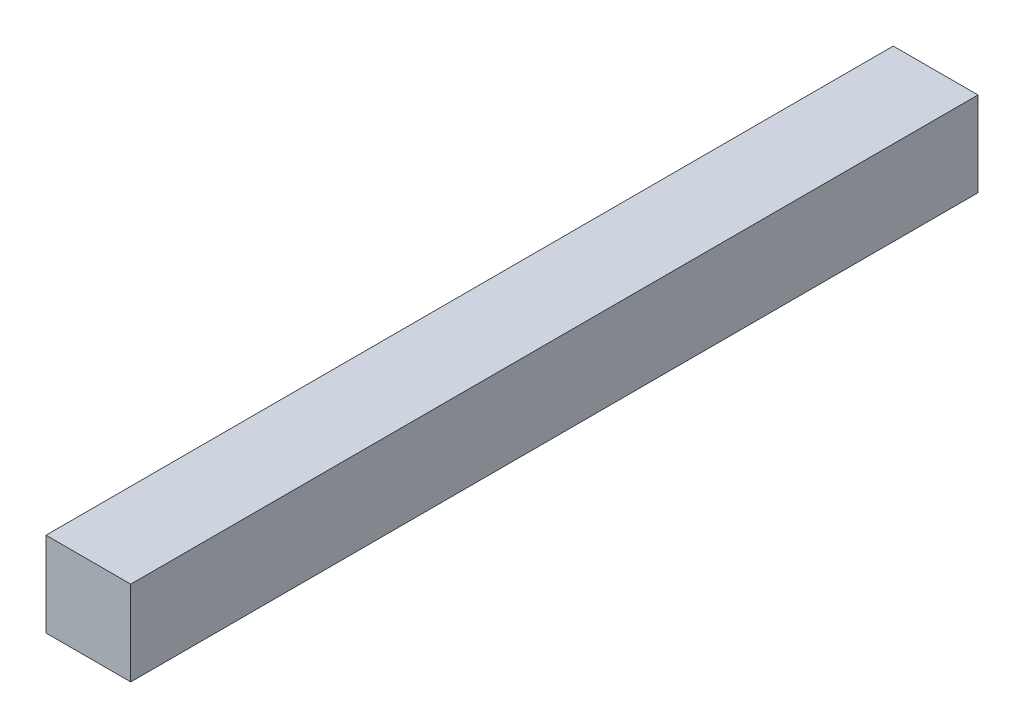
ISO-10303-21;
HEADER;
FILE_DESCRIPTION(('STEP AP214'),'2;1');
FILE_NAME('part.step','',(''),(''),'','','');
FILE_SCHEMA(('AUTOMOTIVE_DESIGN { 1 0 10303 214 1 1 1 1 }'));
ENDSEC;
DATA;
#1=APPLICATION_CONTEXT('core data for automotive mechanical design processes');
#2=APPLICATION_PROTOCOL_DEFINITION('international standard','automotive_design',2000,#1);
#3=PRODUCT_CONTEXT('',#1,'mechanical');
#4=PRODUCT('Part','Part','',(#3));
#5=PRODUCT_RELATED_PRODUCT_CATEGORY('part','',(#4));
#6=PRODUCT_DEFINITION_FORMATION('','',#4);
#7=PRODUCT_DEFINITION_CONTEXT('part definition',#1,'design');
#8=PRODUCT_DEFINITION('design','',#6,#7);
#9=PRODUCT_DEFINITION_SHAPE('','',#8);
#10=(LENGTH_UNIT() NAMED_UNIT(*) SI_UNIT(.MILLI.,.METRE.));
#11=(NAMED_UNIT(*) PLANE_ANGLE_UNIT() SI_UNIT($,.RADIAN.));
#12=(NAMED_UNIT(*) SI_UNIT($,.STERADIAN.) SOLID_ANGLE_UNIT());
#13=UNCERTAINTY_MEASURE_WITH_UNIT(LENGTH_MEASURE(1.E-05),#10,'distance_accuracy_value','');
#14=(GEOMETRIC_REPRESENTATION_CONTEXT(3) GLOBAL_UNCERTAINTY_ASSIGNED_CONTEXT((#13)) GLOBAL_UNIT_ASSIGNED_CONTEXT((#10,
#11,#12)) REPRESENTATION_CONTEXT('',''));
#15=CARTESIAN_POINT('',(0.,0.,0.));
#16=DIRECTION('',(0.,0.,1.));
#17=DIRECTION('',(1.,0.,0.));
#18=AXIS2_PLACEMENT_3D('',#15,#16,#17);
#19=CARTESIAN_POINT('',(15.,15.,300.));
#20=DIRECTION('',(-1.,0.,0.));
#21=DIRECTION('',(0.,-1.,0.));
#22=AXIS2_PLACEMENT_3D('',#19,#20,#21);
#23=PLANE('',#22);
#24=DIRECTION('',(0.,1.,0.));
#25=VECTOR('',#24,1.);
#26=CARTESIAN_POINT('',(15.,15.,0.));
#27=LINE('',#26,#25);
#28=CARTESIAN_POINT('',(15.,-15.,0.));
#29=VERTEX_POINT('',#28);
#30=CARTESIAN_POINT('',(15.,15.,0.));
#31=VERTEX_POINT('',#30);
#32=EDGE_CURVE('E107',#29,#31,#27,.T.);
#33=ORIENTED_EDGE('',*,*,#32,.T.);
#34=DIRECTION('',(0.,0.,-1.));
#35=VECTOR('',#34,1.);
#36=CARTESIAN_POINT('',(15.,15.,300.));
#37=LINE('',#36,#35);
#38=CARTESIAN_POINT('',(15.,15.,300.));
#39=VERTEX_POINT('',#38);
#40=EDGE_CURVE('E11',#39,#31,#37,.T.);
#41=ORIENTED_EDGE('',*,*,#40,.F.);
#42=DIRECTION('',(0.,1.,0.));
#43=VECTOR('',#42,1.);
#44=CARTESIAN_POINT('',(15.,15.,300.));
#45=LINE('',#44,#43);
#46=CARTESIAN_POINT('',(15.,-15.,300.));
#47=VERTEX_POINT('',#46);
#48=EDGE_CURVE('E91',#47,#39,#45,.T.);
#49=ORIENTED_EDGE('',*,*,#48,.F.);
#50=DIRECTION('',(0.,0.,-1.));
#51=VECTOR('',#50,1.);
#52=CARTESIAN_POINT('',(15.,-15.,300.));
#53=LINE('',#52,#51);
#54=EDGE_CURVE('E103',#47,#29,#53,.T.);
#55=ORIENTED_EDGE('',*,*,#54,.T.);
#56=EDGE_LOOP('',(#33,#41,#49,#55));
#57=FACE_BOUND('',#56,.T.);
#58=ADVANCED_FACE('F39',(#57),#23,.F.);
#59=CARTESIAN_POINT('',(-15.,15.,300.));
#60=DIRECTION('',(0.,-1.,0.));
#61=DIRECTION('',(0.,0.,-1.));
#62=AXIS2_PLACEMENT_3D('',#59,#60,#61);
#63=PLANE('',#62);
#64=DIRECTION('',(-1.,0.,0.));
#65=VECTOR('',#64,1.);
#66=CARTESIAN_POINT('',(-15.,15.,0.));
#67=LINE('',#66,#65);
#68=CARTESIAN_POINT('',(-15.,15.,0.));
#69=VERTEX_POINT('',#68);
#70=EDGE_CURVE('E96',#31,#69,#67,.T.);
#71=ORIENTED_EDGE('',*,*,#70,.T.);
#72=DIRECTION('',(0.,0.,-1.));
#73=VECTOR('',#72,1.);
#74=CARTESIAN_POINT('',(-15.,15.,300.));
#75=LINE('',#74,#73);
#76=CARTESIAN_POINT('',(-15.,15.,300.));
#77=VERTEX_POINT('',#76);
#78=EDGE_CURVE('E48',#77,#69,#75,.T.);
#79=ORIENTED_EDGE('',*,*,#78,.F.);
#80=DIRECTION('',(-1.,0.,0.));
#81=VECTOR('',#80,1.);
#82=CARTESIAN_POINT('',(-15.,15.,300.));
#83=LINE('',#82,#81);
#84=EDGE_CURVE('E86',#39,#77,#83,.T.);
#85=ORIENTED_EDGE('',*,*,#84,.F.);
#86=ORIENTED_EDGE('',*,*,#40,.T.);
#87=EDGE_LOOP('',(#71,#79,#85,#86));
#88=FACE_BOUND('',#87,.T.);
#89=ADVANCED_FACE('F95',(#88),#63,.F.);
#90=CARTESIAN_POINT('',(-15.,15.,300.));
#91=DIRECTION('',(1.,0.,0.));
#92=DIRECTION('',(0.,1.,0.));
#93=AXIS2_PLACEMENT_3D('',#90,#91,#92);
#94=PLANE('',#93);
#95=DIRECTION('',(0.,-1.,0.));
#96=VECTOR('',#95,1.);
#97=CARTESIAN_POINT('',(-15.,15.,0.));
#98=LINE('',#97,#96);
#99=CARTESIAN_POINT('',(-15.,-15.,0.));
#100=VERTEX_POINT('',#99);
#101=EDGE_CURVE('E73',#69,#100,#98,.T.);
#102=ORIENTED_EDGE('',*,*,#101,.T.);
#103=DIRECTION('',(0.,0.,-1.));
#104=VECTOR('',#103,1.);
#105=CARTESIAN_POINT('',(-15.,-15.,300.));
#106=LINE('',#105,#104);
#107=CARTESIAN_POINT('',(-15.,-15.,300.));
#108=VERTEX_POINT('',#107);
#109=EDGE_CURVE('E98',#108,#100,#106,.T.);
#110=ORIENTED_EDGE('',*,*,#109,.F.);
#111=DIRECTION('',(0.,-1.,0.));
#112=VECTOR('',#111,1.);
#113=CARTESIAN_POINT('',(-15.,15.,300.));
#114=LINE('',#113,#112);
#115=EDGE_CURVE('E89',#77,#108,#114,.T.);
#116=ORIENTED_EDGE('',*,*,#115,.F.);
#117=ORIENTED_EDGE('',*,*,#78,.T.);
#118=EDGE_LOOP('',(#102,#110,#116,#117));
#119=FACE_BOUND('',#118,.T.);
#120=ADVANCED_FACE('F99',(#119),#94,.F.);
#121=CARTESIAN_POINT('',(-15.,-15.,300.));
#122=DIRECTION('',(0.,1.,0.));
#123=DIRECTION('',(0.,0.,1.));
#124=AXIS2_PLACEMENT_3D('',#121,#122,#123);
#125=PLANE('',#124);
#126=CARTESIAN_POINT('',(0.,-15.,280.));
#127=DIRECTION('',(0.,-1.,0.));
#128=DIRECTION('',(0.,0.,-1.));
#129=AXIS2_PLACEMENT_3D('',#126,#127,#128);
#130=CIRCLE('',#129,10.);
#131=CARTESIAN_POINT('',(0.,-15.,270.));
#132=VERTEX_POINT('',#131);
#133=EDGE_CURVE('E128',#132,#132,#130,.T.);
#134=ORIENTED_EDGE('',*,*,#133,.F.);
#135=EDGE_LOOP('',(#134));
#136=FACE_BOUND('',#135,.T.);
#137=DIRECTION('',(1.,0.,0.));
#138=VECTOR('',#137,1.);
#139=CARTESIAN_POINT('',(-15.,-15.,0.));
#140=LINE('',#139,#138);
#141=EDGE_CURVE('E79',#100,#29,#140,.T.);
#142=ORIENTED_EDGE('',*,*,#141,.T.);
#143=ORIENTED_EDGE('',*,*,#54,.F.);
#144=DIRECTION('',(1.,0.,0.));
#145=VECTOR('',#144,1.);
#146=CARTESIAN_POINT('',(-15.,-15.,300.));
#147=LINE('',#146,#145);
#148=EDGE_CURVE('E56',#108,#47,#147,.T.);
#149=ORIENTED_EDGE('',*,*,#148,.F.);
#150=ORIENTED_EDGE('',*,*,#109,.T.);
#151=EDGE_LOOP('',(#142,#143,#149,#150));
#152=FACE_BOUND('',#151,.T.);
#153=ADVANCED_FACE('F121',(#136,#152),#125,.F.);
#154=CARTESIAN_POINT('',(0.,0.,300.));
#155=DIRECTION('',(0.,0.,1.));
#156=DIRECTION('',(1.,0.,0.));
#157=AXIS2_PLACEMENT_3D('',#154,#155,#156);
#158=PLANE('',#157);
#159=ORIENTED_EDGE('',*,*,#48,.T.);
#160=ORIENTED_EDGE('',*,*,#84,.T.);
#161=ORIENTED_EDGE('',*,*,#115,.T.);
#162=ORIENTED_EDGE('',*,*,#148,.T.);
#163=EDGE_LOOP('',(#159,#160,#161,#162));
#164=FACE_BOUND('',#163,.T.);
#165=ADVANCED_FACE('F87',(#164),#158,.T.);
#166=CARTESIAN_POINT('',(0.,0.,0.));
#167=DIRECTION('',(0.,0.,1.));
#168=DIRECTION('',(1.,0.,0.));
#169=AXIS2_PLACEMENT_3D('',#166,#167,#168);
#170=PLANE('',#169);
#171=ORIENTED_EDGE('',*,*,#32,.F.);
#172=ORIENTED_EDGE('',*,*,#141,.F.);
#173=ORIENTED_EDGE('',*,*,#101,.F.);
#174=ORIENTED_EDGE('',*,*,#70,.F.);
#175=EDGE_LOOP('',(#171,#172,#173,#174));
#176=FACE_BOUND('',#175,.T.);
#177=ADVANCED_FACE('F124',(#176),#170,.F.);
#178=CARTESIAN_POINT('',(0.,-5.,280.));
#179=DIRECTION('',(0.,-1.,0.));
#180=DIRECTION('',(0.,0.,-1.));
#181=AXIS2_PLACEMENT_3D('',#178,#179,#180);
#182=CYLINDRICAL_SURFACE('',#181,10.);
#183=CARTESIAN_POINT('',(0.,-5.,280.));
#184=DIRECTION('',(0.,-1.,0.));
#185=DIRECTION('',(0.,0.,-1.));
#186=AXIS2_PLACEMENT_3D('',#183,#184,#185);
#187=CIRCLE('',#186,10.);
#188=CARTESIAN_POINT('',(0.,-5.,270.));
#189=VERTEX_POINT('',#188);
#190=EDGE_CURVE('E111',#189,#189,#187,.T.);
#191=ORIENTED_EDGE('',*,*,#190,.F.);
#192=EDGE_LOOP('',(#191));
#193=FACE_BOUND('',#192,.T.);
#194=ORIENTED_EDGE('',*,*,#133,.T.);
#195=EDGE_LOOP('',(#194));
#196=FACE_BOUND('',#195,.T.);
#197=ADVANCED_FACE('F138',(#193,#196),#182,.F.);
#198=CARTESIAN_POINT('',(0.,-5.,280.));
#199=DIRECTION('',(0.,-1.,0.));
#200=DIRECTION('',(0.,0.,-1.));
#201=AXIS2_PLACEMENT_3D('',#198,#199,#200);
#202=PLANE('',#201);
#203=ORIENTED_EDGE('',*,*,#190,.T.);
#204=EDGE_LOOP('',(#203));
#205=FACE_BOUND('',#204,.T.);
#206=ADVANCED_FACE('F136',(#205),#202,.T.);
#207=CLOSED_SHELL('',(#58,#89,#120,#153,#165,#177,#197,#206));
#208=MANIFOLD_SOLID_BREP('B2',#207);
#209=ADVANCED_BREP_SHAPE_REPRESENTATION('',(#18,#208),#14);
#210=SHAPE_DEFINITION_REPRESENTATION(#9,#209);
ENDSEC;
END-ISO-10303-21;
